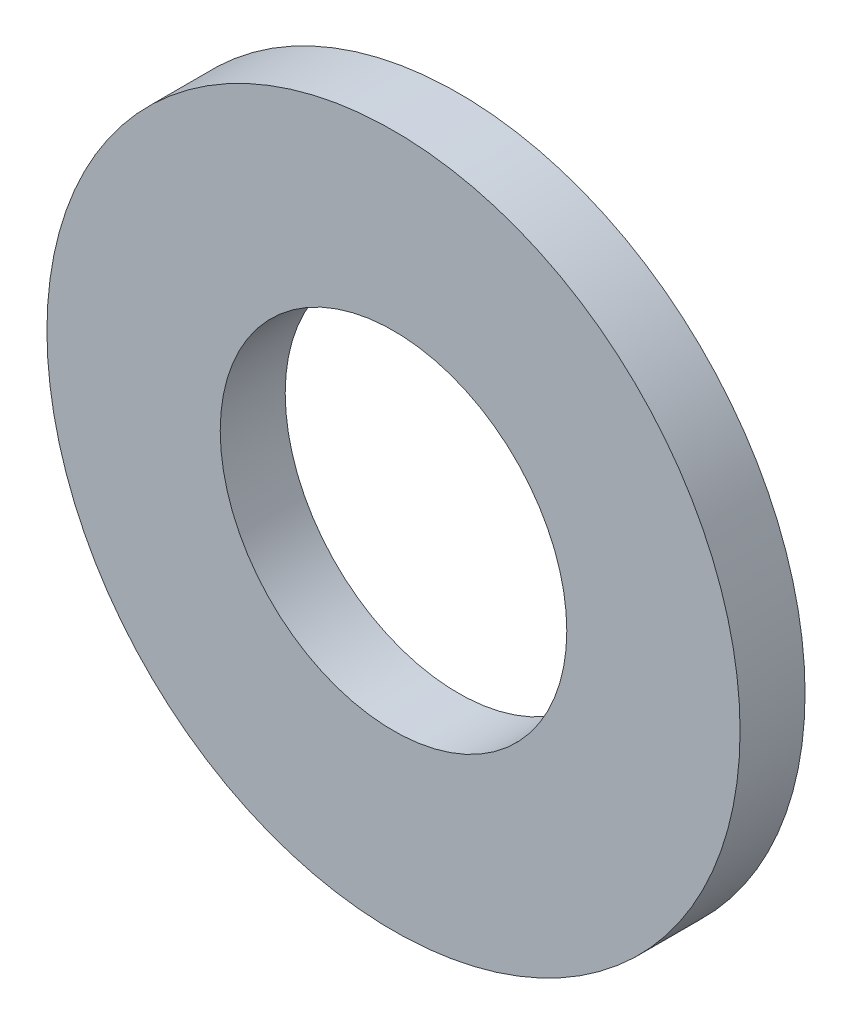
ISO-10303-21;
HEADER;
FILE_DESCRIPTION(('STEP AP214'),'2;1');
FILE_NAME('part.step','',(''),(''),'','','');
FILE_SCHEMA(('AUTOMOTIVE_DESIGN { 1 0 10303 214 1 1 1 1 }'));
ENDSEC;
DATA;
#1=APPLICATION_CONTEXT('core data for automotive mechanical design processes');
#2=APPLICATION_PROTOCOL_DEFINITION('international standard','automotive_design',2000,#1);
#3=PRODUCT_CONTEXT('',#1,'mechanical');
#4=PRODUCT('Part','Part','',(#3));
#5=PRODUCT_RELATED_PRODUCT_CATEGORY('part','',(#4));
#6=PRODUCT_DEFINITION_FORMATION('','',#4);
#7=PRODUCT_DEFINITION_CONTEXT('part definition',#1,'design');
#8=PRODUCT_DEFINITION('design','',#6,#7);
#9=PRODUCT_DEFINITION_SHAPE('','',#8);
#10=(LENGTH_UNIT() NAMED_UNIT(*) SI_UNIT(.MILLI.,.METRE.));
#11=(NAMED_UNIT(*) PLANE_ANGLE_UNIT() SI_UNIT($,.RADIAN.));
#12=(NAMED_UNIT(*) SI_UNIT($,.STERADIAN.) SOLID_ANGLE_UNIT());
#13=UNCERTAINTY_MEASURE_WITH_UNIT(LENGTH_MEASURE(1.E-05),#10,'distance_accuracy_value','');
#14=(GEOMETRIC_REPRESENTATION_CONTEXT(3) GLOBAL_UNCERTAINTY_ASSIGNED_CONTEXT((#13)) GLOBAL_UNIT_ASSIGNED_CONTEXT((#10,
#11,#12)) REPRESENTATION_CONTEXT('',''));
#15=CARTESIAN_POINT('',(0.,0.,0.));
#16=DIRECTION('',(0.,0.,1.));
#17=DIRECTION('',(1.,0.,0.));
#18=AXIS2_PLACEMENT_3D('',#15,#16,#17);
#19=CARTESIAN_POINT('',(0.,0.,1.5));
#20=DIRECTION('',(0.,0.,1.));
#21=DIRECTION('',(1.,0.,0.));
#22=AXIS2_PLACEMENT_3D('',#19,#20,#21);
#23=PLANE('',#22);
#24=CARTESIAN_POINT('',(0.,0.,1.5));
#25=DIRECTION('',(0.,0.,1.));
#26=DIRECTION('',(1.,0.,0.));
#27=AXIS2_PLACEMENT_3D('',#24,#25,#26);
#28=CIRCLE('',#27,8.);
#29=CARTESIAN_POINT('',(8.,0.,1.5));
#30=VERTEX_POINT('',#29);
#31=EDGE_CURVE('E10',#30,#30,#28,.T.);
#32=ORIENTED_EDGE('',*,*,#31,.T.);
#33=EDGE_LOOP('',(#32));
#34=FACE_BOUND('',#33,.T.);
#35=CARTESIAN_POINT('',(0.,0.,1.5));
#36=DIRECTION('',(0.,0.,1.));
#37=DIRECTION('',(1.,0.,0.));
#38=AXIS2_PLACEMENT_3D('',#35,#36,#37);
#39=CIRCLE('',#38,4.);
#40=CARTESIAN_POINT('',(4.,0.,1.5));
#41=VERTEX_POINT('',#40);
#42=EDGE_CURVE('E42',#41,#41,#39,.T.);
#43=ORIENTED_EDGE('',*,*,#42,.F.);
#44=EDGE_LOOP('',(#43));
#45=FACE_BOUND('',#44,.T.);
#46=ADVANCED_FACE('F31',(#34,#45),#23,.T.);
#47=CARTESIAN_POINT('',(0.,0.,0.));
#48=DIRECTION('',(0.,0.,1.));
#49=DIRECTION('',(1.,0.,0.));
#50=AXIS2_PLACEMENT_3D('',#47,#48,#49);
#51=PLANE('',#50);
#52=CARTESIAN_POINT('',(0.,0.,0.));
#53=DIRECTION('',(0.,0.,1.));
#54=DIRECTION('',(1.,0.,0.));
#55=AXIS2_PLACEMENT_3D('',#52,#53,#54);
#56=CIRCLE('',#55,8.);
#57=CARTESIAN_POINT('',(8.,0.,0.));
#58=VERTEX_POINT('',#57);
#59=EDGE_CURVE('E35',#58,#58,#56,.T.);
#60=ORIENTED_EDGE('',*,*,#59,.F.);
#61=EDGE_LOOP('',(#60));
#62=FACE_BOUND('',#61,.T.);
#63=CARTESIAN_POINT('',(0.,0.,0.));
#64=DIRECTION('',(0.,0.,1.));
#65=DIRECTION('',(1.,0.,0.));
#66=AXIS2_PLACEMENT_3D('',#63,#64,#65);
#67=CIRCLE('',#66,4.);
#68=CARTESIAN_POINT('',(4.,0.,0.));
#69=VERTEX_POINT('',#68);
#70=EDGE_CURVE('E44',#69,#69,#67,.T.);
#71=ORIENTED_EDGE('',*,*,#70,.T.);
#72=EDGE_LOOP('',(#71));
#73=FACE_BOUND('',#72,.T.);
#74=ADVANCED_FACE('F54',(#62,#73),#51,.F.);
#75=CARTESIAN_POINT('',(0.,0.,1.5));
#76=DIRECTION('',(0.,0.,-1.));
#77=DIRECTION('',(-1.,0.,0.));
#78=AXIS2_PLACEMENT_3D('',#75,#76,#77);
#79=CYLINDRICAL_SURFACE('',#78,8.);
#80=ORIENTED_EDGE('',*,*,#31,.F.);
#81=EDGE_LOOP('',(#80));
#82=FACE_BOUND('',#81,.T.);
#83=ORIENTED_EDGE('',*,*,#59,.T.);
#84=EDGE_LOOP('',(#83));
#85=FACE_BOUND('',#84,.T.);
#86=ADVANCED_FACE('F33',(#82,#85),#79,.T.);
#87=CARTESIAN_POINT('',(0.,0.,1.5));
#88=DIRECTION('',(0.,0.,-1.));
#89=DIRECTION('',(-1.,0.,0.));
#90=AXIS2_PLACEMENT_3D('',#87,#88,#89);
#91=CYLINDRICAL_SURFACE('',#90,4.);
#92=ORIENTED_EDGE('',*,*,#42,.T.);
#93=EDGE_LOOP('',(#92));
#94=FACE_BOUND('',#93,.T.);
#95=ORIENTED_EDGE('',*,*,#70,.F.);
#96=EDGE_LOOP('',(#95));
#97=FACE_BOUND('',#96,.T.);
#98=ADVANCED_FACE('F50',(#94,#97),#91,.F.);
#99=CLOSED_SHELL('',(#46,#74,#86,#98));
#100=MANIFOLD_SOLID_BREP('B2',#99);
#101=ADVANCED_BREP_SHAPE_REPRESENTATION('',(#18,#100),#14);
#102=SHAPE_DEFINITION_REPRESENTATION(#9,#101);
ENDSEC;
END-ISO-10303-21;
